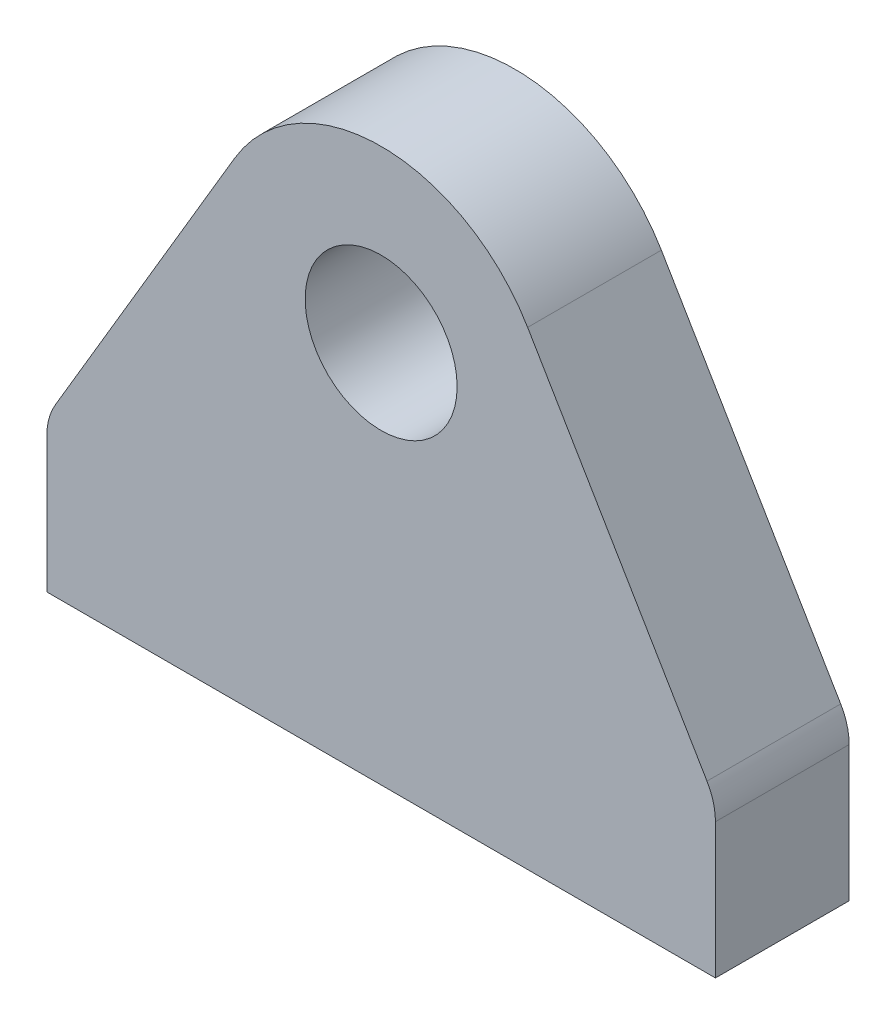
ISO-10303-21;
HEADER;
FILE_DESCRIPTION(('STEP AP214'),'2;1');
FILE_NAME('part.step','',(''),(''),'','','');
FILE_SCHEMA(('AUTOMOTIVE_DESIGN { 1 0 10303 214 1 1 1 1 }'));
ENDSEC;
DATA;
#1=APPLICATION_CONTEXT('core data for automotive mechanical design processes');
#2=APPLICATION_PROTOCOL_DEFINITION('international standard','automotive_design',2000,#1);
#3=PRODUCT_CONTEXT('',#1,'mechanical');
#4=PRODUCT('Part','Part','',(#3));
#5=PRODUCT_RELATED_PRODUCT_CATEGORY('part','',(#4));
#6=PRODUCT_DEFINITION_FORMATION('','',#4);
#7=PRODUCT_DEFINITION_CONTEXT('part definition',#1,'design');
#8=PRODUCT_DEFINITION('design','',#6,#7);
#9=PRODUCT_DEFINITION_SHAPE('','',#8);
#10=(LENGTH_UNIT() NAMED_UNIT(*) SI_UNIT(.MILLI.,.METRE.));
#11=(NAMED_UNIT(*) PLANE_ANGLE_UNIT() SI_UNIT($,.RADIAN.));
#12=(NAMED_UNIT(*) SI_UNIT($,.STERADIAN.) SOLID_ANGLE_UNIT());
#13=UNCERTAINTY_MEASURE_WITH_UNIT(LENGTH_MEASURE(1.E-05),#10,'distance_accuracy_value','');
#14=(GEOMETRIC_REPRESENTATION_CONTEXT(3) GLOBAL_UNCERTAINTY_ASSIGNED_CONTEXT((#13)) GLOBAL_UNIT_ASSIGNED_CONTEXT((#10,
#11,#12)) REPRESENTATION_CONTEXT('',''));
#15=CARTESIAN_POINT('',(0.,0.,0.));
#16=DIRECTION('',(0.,0.,1.));
#17=DIRECTION('',(1.,0.,0.));
#18=AXIS2_PLACEMENT_3D('',#15,#16,#17);
#19=CARTESIAN_POINT('',(0.,63.,11.));
#20=DIRECTION('',(0.,0.,-1.));
#21=DIRECTION('',(-1.,0.,0.));
#22=AXIS2_PLACEMENT_3D('',#19,#20,#21);
#23=CYLINDRICAL_SURFACE('',#22,28.);
#24=CARTESIAN_POINT('',(0.,63.,11.));
#25=DIRECTION('',(0.,0.,1.));
#26=DIRECTION('',(-1.,0.,0.));
#27=AXIS2_PLACEMENT_3D('',#24,#25,#26);
#28=CIRCLE('',#27,28.);
#29=CARTESIAN_POINT('',(24.101425307018,77.2520629443682,11.));
#30=VERTEX_POINT('',#29);
#31=CARTESIAN_POINT('',(-24.101425307018,77.2520629443682,11.));
#32=VERTEX_POINT('',#31);
#33=EDGE_CURVE('E115',#30,#32,#28,.T.);
#34=ORIENTED_EDGE('',*,*,#33,.F.);
#35=DIRECTION('',(0.,0.,1.));
#36=VECTOR('',#35,1.);
#37=CARTESIAN_POINT('',(24.101425307018,77.2520629443682,-71.7042008431048));
#38=LINE('',#37,#36);
#39=CARTESIAN_POINT('',(24.101425307018,77.2520629443682,-11.));
#40=VERTEX_POINT('',#39);
#41=EDGE_CURVE('E103',#40,#30,#38,.T.);
#42=ORIENTED_EDGE('',*,*,#41,.F.);
#43=CARTESIAN_POINT('',(0.,63.,-11.));
#44=DIRECTION('',(0.,0.,1.));
#45=DIRECTION('',(-1.,0.,0.));
#46=AXIS2_PLACEMENT_3D('',#43,#44,#45);
#47=CIRCLE('',#46,28.);
#48=CARTESIAN_POINT('',(-24.101425307018,77.2520629443682,-11.));
#49=VERTEX_POINT('',#48);
#50=EDGE_CURVE('E113',#40,#49,#47,.T.);
#51=ORIENTED_EDGE('',*,*,#50,.T.);
#52=DIRECTION('',(0.,0.,1.));
#53=VECTOR('',#52,1.);
#54=CARTESIAN_POINT('',(-24.101425307018,77.2520629443682,-71.7042008431048));
#55=LINE('',#54,#53);
#56=EDGE_CURVE('E170',#49,#32,#55,.T.);
#57=ORIENTED_EDGE('',*,*,#56,.T.);
#58=EDGE_LOOP('',(#34,#42,#51,#57));
#59=FACE_BOUND('',#58,.T.);
#60=ADVANCED_FACE('F33',(#59),#23,.T.);
#61=CARTESIAN_POINT('',(0.,63.,11.));
#62=DIRECTION('',(0.,0.,-1.));
#63=DIRECTION('',(-1.,0.,0.));
#64=AXIS2_PLACEMENT_3D('',#61,#62,#63);
#65=PLANE('',#64);
#66=DIRECTION('',(0.,1.,0.));
#67=VECTOR('',#66,1.);
#68=CARTESIAN_POINT('',(55.,0.,11.));
#69=LINE('',#68,#67);
#70=CARTESIAN_POINT('',(55.,0.,11.));
#71=VERTEX_POINT('',#70);
#72=CARTESIAN_POINT('',(55.,22.2645541152886,11.));
#73=VERTEX_POINT('',#72);
#74=EDGE_CURVE('E164',#71,#73,#69,.T.);
#75=ORIENTED_EDGE('',*,*,#74,.T.);
#76=CARTESIAN_POINT('',(45.,22.2645541152886,11.));
#77=DIRECTION('',(0.,0.,-1.));
#78=DIRECTION('',(-1.,0.,0.));
#79=AXIS2_PLACEMENT_3D('',#76,#77,#78);
#80=CIRCLE('',#79,10.);
#81=CARTESIAN_POINT('',(53.6076518953636,27.35457659542,11.));
#82=VERTEX_POINT('',#81);
#83=EDGE_CURVE('E146',#73,#82,#80,.F.);
#84=ORIENTED_EDGE('',*,*,#83,.T.);
#85=DIRECTION('',(-0.509002248013149,0.860765189536358,0.));
#86=VECTOR('',#85,1.);
#87=CARTESIAN_POINT('',(55.,25.,11.));
#88=LINE('',#87,#86);
#89=EDGE_CURVE('E109',#82,#30,#88,.T.);
#90=ORIENTED_EDGE('',*,*,#89,.T.);
#91=ORIENTED_EDGE('',*,*,#33,.T.);
#92=DIRECTION('',(-0.509002248013148,-0.860765189536357,0.));
#93=VECTOR('',#92,1.);
#94=CARTESIAN_POINT('',(-55.,25.,11.));
#95=LINE('',#94,#93);
#96=CARTESIAN_POINT('',(-53.6076518953636,27.35457659542,11.));
#97=VERTEX_POINT('',#96);
#98=EDGE_CURVE('E116',#32,#97,#95,.T.);
#99=ORIENTED_EDGE('',*,*,#98,.T.);
#100=CARTESIAN_POINT('',(-45.,22.2645541152886,11.));
#101=DIRECTION('',(0.,0.,-1.));
#102=DIRECTION('',(-1.,0.,0.));
#103=AXIS2_PLACEMENT_3D('',#100,#101,#102);
#104=CIRCLE('',#103,10.);
#105=CARTESIAN_POINT('',(-55.,22.2645541152886,11.));
#106=VERTEX_POINT('',#105);
#107=EDGE_CURVE('E48',#97,#106,#104,.F.);
#108=ORIENTED_EDGE('',*,*,#107,.T.);
#109=DIRECTION('',(0.,-1.,0.));
#110=VECTOR('',#109,1.);
#111=CARTESIAN_POINT('',(-55.,0.,11.));
#112=LINE('',#111,#110);
#113=CARTESIAN_POINT('',(-55.,0.,11.));
#114=VERTEX_POINT('',#113);
#115=EDGE_CURVE('E122',#106,#114,#112,.T.);
#116=ORIENTED_EDGE('',*,*,#115,.T.);
#117=DIRECTION('',(1.,0.,0.));
#118=VECTOR('',#117,1.);
#119=CARTESIAN_POINT('',(-55.,0.,11.));
#120=LINE('',#119,#118);
#121=EDGE_CURVE('E125',#114,#71,#120,.T.);
#122=ORIENTED_EDGE('',*,*,#121,.T.);
#123=EDGE_LOOP('',(#75,#84,#90,#91,#99,#108,#116,#122));
#124=FACE_BOUND('',#123,.T.);
#125=CARTESIAN_POINT('',(0.,63.,11.));
#126=DIRECTION('',(0.,0.,1.));
#127=DIRECTION('',(1.,0.,0.));
#128=AXIS2_PLACEMENT_3D('',#125,#126,#127);
#129=CIRCLE('',#128,12.5);
#130=CARTESIAN_POINT('',(12.5,63.,11.));
#131=VERTEX_POINT('',#130);
#132=EDGE_CURVE('E157',#131,#131,#129,.T.);
#133=ORIENTED_EDGE('',*,*,#132,.F.);
#134=EDGE_LOOP('',(#133));
#135=FACE_BOUND('',#134,.T.);
#136=ADVANCED_FACE('F174',(#124,#135),#65,.F.);
#137=CARTESIAN_POINT('',(0.,63.,-11.));
#138=DIRECTION('',(0.,0.,-1.));
#139=DIRECTION('',(-1.,0.,0.));
#140=AXIS2_PLACEMENT_3D('',#137,#138,#139);
#141=PLANE('',#140);
#142=DIRECTION('',(-0.509002248013149,0.860765189536358,0.));
#143=VECTOR('',#142,1.);
#144=CARTESIAN_POINT('',(55.,25.,-11.));
#145=LINE('',#144,#143);
#146=CARTESIAN_POINT('',(53.6076518953636,27.35457659542,-11.));
#147=VERTEX_POINT('',#146);
#148=EDGE_CURVE('E99',#147,#40,#145,.T.);
#149=ORIENTED_EDGE('',*,*,#148,.F.);
#150=CARTESIAN_POINT('',(45.,22.2645541152886,-11.));
#151=DIRECTION('',(0.,0.,-1.));
#152=DIRECTION('',(-1.,0.,0.));
#153=AXIS2_PLACEMENT_3D('',#150,#151,#152);
#154=CIRCLE('',#153,10.);
#155=CARTESIAN_POINT('',(55.,22.2645541152886,-11.));
#156=VERTEX_POINT('',#155);
#157=EDGE_CURVE('E141',#147,#156,#154,.T.);
#158=ORIENTED_EDGE('',*,*,#157,.T.);
#159=DIRECTION('',(0.,1.,0.));
#160=VECTOR('',#159,1.);
#161=CARTESIAN_POINT('',(55.,0.,-11.));
#162=LINE('',#161,#160);
#163=CARTESIAN_POINT('',(55.,0.,-11.));
#164=VERTEX_POINT('',#163);
#165=EDGE_CURVE('E123',#164,#156,#162,.T.);
#166=ORIENTED_EDGE('',*,*,#165,.F.);
#167=DIRECTION('',(1.,0.,0.));
#168=VECTOR('',#167,1.);
#169=CARTESIAN_POINT('',(-55.,0.,-11.));
#170=LINE('',#169,#168);
#171=CARTESIAN_POINT('',(-55.,0.,-11.));
#172=VERTEX_POINT('',#171);
#173=EDGE_CURVE('E128',#172,#164,#170,.T.);
#174=ORIENTED_EDGE('',*,*,#173,.F.);
#175=DIRECTION('',(0.,-1.,0.));
#176=VECTOR('',#175,1.);
#177=CARTESIAN_POINT('',(-55.,0.,-11.));
#178=LINE('',#177,#176);
#179=CARTESIAN_POINT('',(-55.,22.2645541152886,-11.));
#180=VERTEX_POINT('',#179);
#181=EDGE_CURVE('E153',#180,#172,#178,.T.);
#182=ORIENTED_EDGE('',*,*,#181,.F.);
#183=CARTESIAN_POINT('',(-45.,22.2645541152886,-11.));
#184=DIRECTION('',(0.,0.,-1.));
#185=DIRECTION('',(-1.,0.,0.));
#186=AXIS2_PLACEMENT_3D('',#183,#184,#185);
#187=CIRCLE('',#186,10.);
#188=CARTESIAN_POINT('',(-53.6076518953636,27.35457659542,-11.));
#189=VERTEX_POINT('',#188);
#190=EDGE_CURVE('E139',#180,#189,#187,.T.);
#191=ORIENTED_EDGE('',*,*,#190,.T.);
#192=DIRECTION('',(-0.509002248013148,-0.860765189536358,0.));
#193=VECTOR('',#192,1.);
#194=CARTESIAN_POINT('',(-55.,25.,-11.));
#195=LINE('',#194,#193);
#196=EDGE_CURVE('E120',#49,#189,#195,.T.);
#197=ORIENTED_EDGE('',*,*,#196,.F.);
#198=ORIENTED_EDGE('',*,*,#50,.F.);
#199=EDGE_LOOP('',(#149,#158,#166,#174,#182,#191,#197,#198));
#200=FACE_BOUND('',#199,.T.);
#201=CARTESIAN_POINT('',(0.,63.,-11.));
#202=DIRECTION('',(0.,0.,1.));
#203=DIRECTION('',(1.,0.,0.));
#204=AXIS2_PLACEMENT_3D('',#201,#202,#203);
#205=CIRCLE('',#204,12.5);
#206=CARTESIAN_POINT('',(12.5,63.,-11.));
#207=VERTEX_POINT('',#206);
#208=EDGE_CURVE('E160',#207,#207,#205,.T.);
#209=ORIENTED_EDGE('',*,*,#208,.T.);
#210=EDGE_LOOP('',(#209));
#211=FACE_BOUND('',#210,.T.);
#212=ADVANCED_FACE('F118',(#200,#211),#141,.T.);
#213=CARTESIAN_POINT('',(-55.,0.,11.));
#214=DIRECTION('',(1.,0.,0.));
#215=DIRECTION('',(0.,0.,-1.));
#216=AXIS2_PLACEMENT_3D('',#213,#214,#215);
#217=PLANE('',#216);
#218=ORIENTED_EDGE('',*,*,#115,.F.);
#219=DIRECTION('',(0.,0.,-1.));
#220=VECTOR('',#219,1.);
#221=CARTESIAN_POINT('',(-55.,22.2645541152886,-11.));
#222=LINE('',#221,#220);
#223=EDGE_CURVE('E41',#106,#180,#222,.T.);
#224=ORIENTED_EDGE('',*,*,#223,.T.);
#225=ORIENTED_EDGE('',*,*,#181,.T.);
#226=DIRECTION('',(0.,0.,-1.));
#227=VECTOR('',#226,1.);
#228=CARTESIAN_POINT('',(-55.,0.,11.));
#229=LINE('',#228,#227);
#230=EDGE_CURVE('E135',#114,#172,#229,.T.);
#231=ORIENTED_EDGE('',*,*,#230,.F.);
#232=EDGE_LOOP('',(#218,#224,#225,#231));
#233=FACE_BOUND('',#232,.T.);
#234=ADVANCED_FACE('F151',(#233),#217,.F.);
#235=CARTESIAN_POINT('',(-55.,0.,11.));
#236=DIRECTION('',(0.,1.,0.));
#237=DIRECTION('',(0.,0.,1.));
#238=AXIS2_PLACEMENT_3D('',#235,#236,#237);
#239=PLANE('',#238);
#240=ORIENTED_EDGE('',*,*,#173,.T.);
#241=DIRECTION('',(0.,0.,-1.));
#242=VECTOR('',#241,1.);
#243=CARTESIAN_POINT('',(55.,0.,11.));
#244=LINE('',#243,#242);
#245=EDGE_CURVE('E132',#71,#164,#244,.T.);
#246=ORIENTED_EDGE('',*,*,#245,.F.);
#247=ORIENTED_EDGE('',*,*,#121,.F.);
#248=ORIENTED_EDGE('',*,*,#230,.T.);
#249=EDGE_LOOP('',(#240,#246,#247,#248));
#250=FACE_BOUND('',#249,.T.);
#251=ADVANCED_FACE('F186',(#250),#239,.F.);
#252=CARTESIAN_POINT('',(55.,0.,11.));
#253=DIRECTION('',(-1.,0.,0.));
#254=DIRECTION('',(0.,-1.,0.));
#255=AXIS2_PLACEMENT_3D('',#252,#253,#254);
#256=PLANE('',#255);
#257=ORIENTED_EDGE('',*,*,#165,.T.);
#258=DIRECTION('',(0.,0.,-1.));
#259=VECTOR('',#258,1.);
#260=CARTESIAN_POINT('',(55.,22.2645541152886,11.));
#261=LINE('',#260,#259);
#262=EDGE_CURVE('E143',#156,#73,#261,.F.);
#263=ORIENTED_EDGE('',*,*,#262,.T.);
#264=ORIENTED_EDGE('',*,*,#74,.F.);
#265=ORIENTED_EDGE('',*,*,#245,.T.);
#266=EDGE_LOOP('',(#257,#263,#264,#265));
#267=FACE_BOUND('',#266,.T.);
#268=ADVANCED_FACE('F181',(#267),#256,.F.);
#269=CARTESIAN_POINT('',(0.,63.,11.));
#270=DIRECTION('',(0.,0.,-1.));
#271=DIRECTION('',(-1.,0.,0.));
#272=AXIS2_PLACEMENT_3D('',#269,#270,#271);
#273=CYLINDRICAL_SURFACE('',#272,12.5);
#274=ORIENTED_EDGE('',*,*,#132,.T.);
#275=EDGE_LOOP('',(#274));
#276=FACE_BOUND('',#275,.T.);
#277=ORIENTED_EDGE('',*,*,#208,.F.);
#278=EDGE_LOOP('',(#277));
#279=FACE_BOUND('',#278,.T.);
#280=ADVANCED_FACE('F194',(#276,#279),#273,.F.);
#281=CARTESIAN_POINT('',(-55.,25.,-71.7042008431048));
#282=DIRECTION('',(-0.860765189536358,0.509002248013148,0.));
#283=DIRECTION('',(-0.509002248013148,-0.860765189536358,0.));
#284=AXIS2_PLACEMENT_3D('',#281,#282,#283);
#285=PLANE('',#284);
#286=ORIENTED_EDGE('',*,*,#196,.T.);
#287=DIRECTION('',(0.,0.,-1.));
#288=VECTOR('',#287,1.);
#289=CARTESIAN_POINT('',(-53.6076518953636,27.35457659542,11.));
#290=LINE('',#289,#288);
#291=EDGE_CURVE('E11',#189,#97,#290,.F.);
#292=ORIENTED_EDGE('',*,*,#291,.T.);
#293=ORIENTED_EDGE('',*,*,#98,.F.);
#294=ORIENTED_EDGE('',*,*,#56,.F.);
#295=EDGE_LOOP('',(#286,#292,#293,#294));
#296=FACE_BOUND('',#295,.T.);
#297=ADVANCED_FACE('F211',(#296),#285,.T.);
#298=CARTESIAN_POINT('',(55.,25.,-71.7042008431048));
#299=DIRECTION('',(0.860765189536358,0.509002248013149,0.));
#300=DIRECTION('',(-0.509002248013149,0.860765189536358,0.));
#301=AXIS2_PLACEMENT_3D('',#298,#299,#300);
#302=PLANE('',#301);
#303=ORIENTED_EDGE('',*,*,#89,.F.);
#304=DIRECTION('',(0.,0.,-1.));
#305=VECTOR('',#304,1.);
#306=CARTESIAN_POINT('',(53.6076518953636,27.35457659542,-11.));
#307=LINE('',#306,#305);
#308=EDGE_CURVE('E106',#82,#147,#307,.T.);
#309=ORIENTED_EDGE('',*,*,#308,.T.);
#310=ORIENTED_EDGE('',*,*,#148,.T.);
#311=ORIENTED_EDGE('',*,*,#41,.T.);
#312=EDGE_LOOP('',(#303,#309,#310,#311));
#313=FACE_BOUND('',#312,.T.);
#314=ADVANCED_FACE('F102',(#313),#302,.T.);
#315=CARTESIAN_POINT('',(45.,22.2645541152886,-71.7042008431048));
#316=DIRECTION('',(0.,0.,1.));
#317=DIRECTION('',(1.,0.,0.));
#318=AXIS2_PLACEMENT_3D('',#315,#316,#317);
#319=CYLINDRICAL_SURFACE('',#318,10.);
#320=ORIENTED_EDGE('',*,*,#83,.F.);
#321=ORIENTED_EDGE('',*,*,#262,.F.);
#322=ORIENTED_EDGE('',*,*,#157,.F.);
#323=ORIENTED_EDGE('',*,*,#308,.F.);
#324=EDGE_LOOP('',(#320,#321,#322,#323));
#325=FACE_BOUND('',#324,.T.);
#326=ADVANCED_FACE('F178',(#325),#319,.T.);
#327=CARTESIAN_POINT('',(-45.,22.2645541152886,11.));
#328=DIRECTION('',(0.,0.,1.));
#329=DIRECTION('',(1.,0.,0.));
#330=AXIS2_PLACEMENT_3D('',#327,#328,#329);
#331=CYLINDRICAL_SURFACE('',#330,10.);
#332=ORIENTED_EDGE('',*,*,#107,.F.);
#333=ORIENTED_EDGE('',*,*,#291,.F.);
#334=ORIENTED_EDGE('',*,*,#190,.F.);
#335=ORIENTED_EDGE('',*,*,#223,.F.);
#336=EDGE_LOOP('',(#332,#333,#334,#335));
#337=FACE_BOUND('',#336,.T.);
#338=ADVANCED_FACE('F35',(#337),#331,.T.);
#339=CLOSED_SHELL('',(#60,#136,#212,#234,#251,#268,#280,#297,#314,#326,#338));
#340=MANIFOLD_SOLID_BREP('B2',#339);
#341=ADVANCED_BREP_SHAPE_REPRESENTATION('',(#18,#340),#14);
#342=SHAPE_DEFINITION_REPRESENTATION(#9,#341);
ENDSEC;
END-ISO-10303-21;
